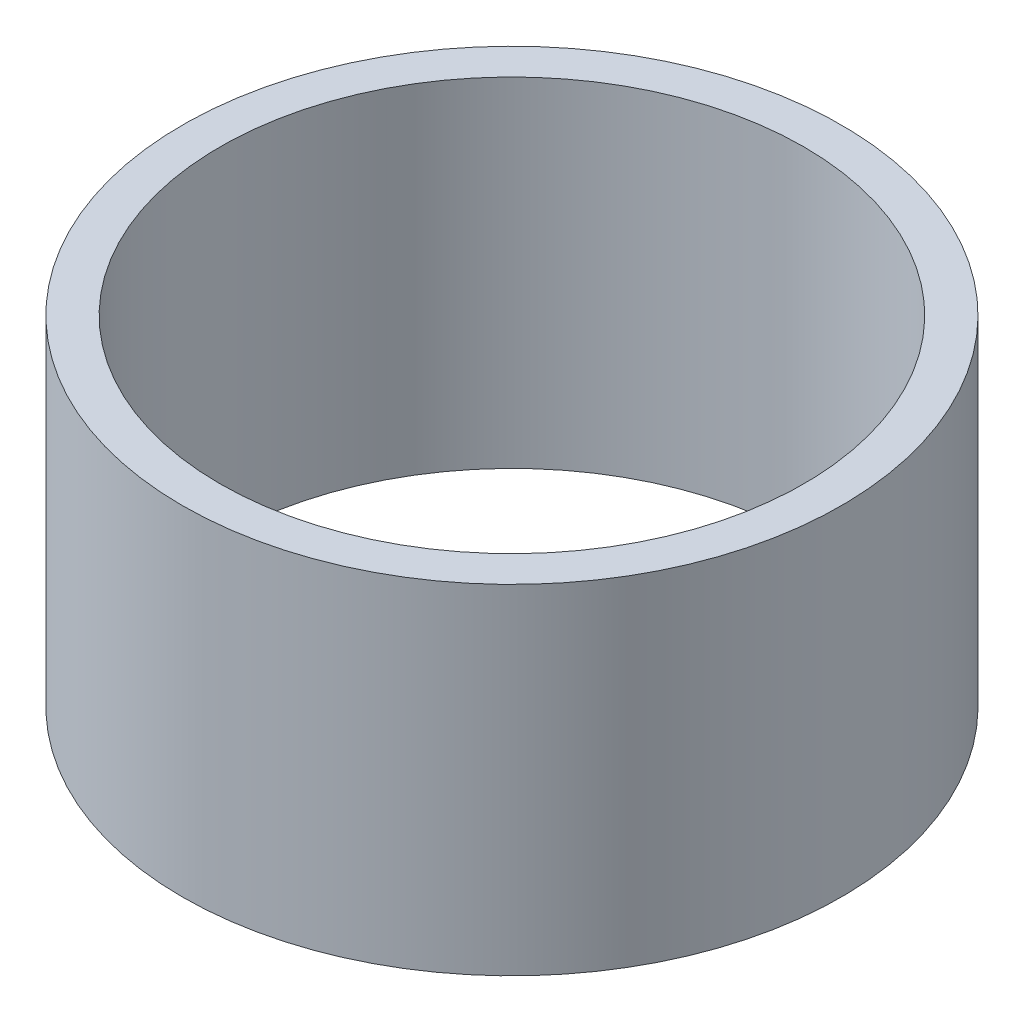
ISO-10303-21;
HEADER;
FILE_DESCRIPTION(('STEP AP214'),'2;1');
FILE_NAME('part.step','',(''),(''),'','','');
FILE_SCHEMA(('AUTOMOTIVE_DESIGN { 1 0 10303 214 1 1 1 1 }'));
ENDSEC;
DATA;
#1=APPLICATION_CONTEXT('core data for automotive mechanical design processes');
#2=APPLICATION_PROTOCOL_DEFINITION('international standard','automotive_design',2000,#1);
#3=PRODUCT_CONTEXT('',#1,'mechanical');
#4=PRODUCT('Part','Part','',(#3));
#5=PRODUCT_RELATED_PRODUCT_CATEGORY('part','',(#4));
#6=PRODUCT_DEFINITION_FORMATION('','',#4);
#7=PRODUCT_DEFINITION_CONTEXT('part definition',#1,'design');
#8=PRODUCT_DEFINITION('design','',#6,#7);
#9=PRODUCT_DEFINITION_SHAPE('','',#8);
#10=(LENGTH_UNIT() NAMED_UNIT(*) SI_UNIT(.MILLI.,.METRE.));
#11=(NAMED_UNIT(*) PLANE_ANGLE_UNIT() SI_UNIT($,.RADIAN.));
#12=(NAMED_UNIT(*) SI_UNIT($,.STERADIAN.) SOLID_ANGLE_UNIT());
#13=UNCERTAINTY_MEASURE_WITH_UNIT(LENGTH_MEASURE(1.E-05),#10,'distance_accuracy_value','');
#14=(GEOMETRIC_REPRESENTATION_CONTEXT(3) GLOBAL_UNCERTAINTY_ASSIGNED_CONTEXT((#13)) GLOBAL_UNIT_ASSIGNED_CONTEXT((#10,
#11,#12)) REPRESENTATION_CONTEXT('',''));
#15=CARTESIAN_POINT('',(0.,0.,0.));
#16=DIRECTION('',(0.,0.,1.));
#17=DIRECTION('',(1.,0.,0.));
#18=AXIS2_PLACEMENT_3D('',#15,#16,#17);
#19=CARTESIAN_POINT('',(0.,18.,0.));
#20=DIRECTION('',(0.,-1.,0.));
#21=DIRECTION('',(0.,0.,-1.));
#22=AXIS2_PLACEMENT_3D('',#19,#20,#21);
#23=CYLINDRICAL_SURFACE('',#22,17.5);
#24=CARTESIAN_POINT('',(0.,18.,0.));
#25=DIRECTION('',(0.,1.,0.));
#26=DIRECTION('',(0.,0.,1.));
#27=AXIS2_PLACEMENT_3D('',#24,#25,#26);
#28=CIRCLE('',#27,17.5);
#29=CARTESIAN_POINT('',(0.,18.,17.5));
#30=VERTEX_POINT('',#29);
#31=EDGE_CURVE('E10',#30,#30,#28,.T.);
#32=ORIENTED_EDGE('',*,*,#31,.F.);
#33=EDGE_LOOP('',(#32));
#34=FACE_BOUND('',#33,.T.);
#35=CARTESIAN_POINT('',(0.,0.,0.));
#36=DIRECTION('',(0.,1.,0.));
#37=DIRECTION('',(0.,0.,1.));
#38=AXIS2_PLACEMENT_3D('',#35,#36,#37);
#39=CIRCLE('',#38,17.5);
#40=CARTESIAN_POINT('',(0.,0.,17.5));
#41=VERTEX_POINT('',#40);
#42=EDGE_CURVE('E42',#41,#41,#39,.T.);
#43=ORIENTED_EDGE('',*,*,#42,.T.);
#44=EDGE_LOOP('',(#43));
#45=FACE_BOUND('',#44,.T.);
#46=ADVANCED_FACE('F39',(#34,#45),#23,.T.);
#47=CARTESIAN_POINT('',(0.,18.,0.));
#48=DIRECTION('',(0.,1.,0.));
#49=DIRECTION('',(0.,0.,1.));
#50=AXIS2_PLACEMENT_3D('',#47,#48,#49);
#51=PLANE('',#50);
#52=CARTESIAN_POINT('',(0.,18.,0.));
#53=DIRECTION('',(0.,1.,0.));
#54=DIRECTION('',(0.,0.,1.));
#55=AXIS2_PLACEMENT_3D('',#52,#53,#54);
#56=CIRCLE('',#55,15.5);
#57=CARTESIAN_POINT('',(0.,18.,15.5));
#58=VERTEX_POINT('',#57);
#59=EDGE_CURVE('E56',#58,#58,#56,.T.);
#60=ORIENTED_EDGE('',*,*,#59,.F.);
#61=EDGE_LOOP('',(#60));
#62=FACE_BOUND('',#61,.T.);
#63=ORIENTED_EDGE('',*,*,#31,.T.);
#64=EDGE_LOOP('',(#63));
#65=FACE_BOUND('',#64,.T.);
#66=ADVANCED_FACE('F63',(#62,#65),#51,.T.);
#67=CARTESIAN_POINT('',(0.,0.,0.));
#68=DIRECTION('',(0.,1.,0.));
#69=DIRECTION('',(0.,0.,1.));
#70=AXIS2_PLACEMENT_3D('',#67,#68,#69);
#71=PLANE('',#70);
#72=CARTESIAN_POINT('',(0.,0.,0.));
#73=DIRECTION('',(0.,1.,0.));
#74=DIRECTION('',(0.,0.,1.));
#75=AXIS2_PLACEMENT_3D('',#72,#73,#74);
#76=CIRCLE('',#75,15.5);
#77=CARTESIAN_POINT('',(0.,0.,15.5));
#78=VERTEX_POINT('',#77);
#79=EDGE_CURVE('E51',#78,#78,#76,.F.);
#80=ORIENTED_EDGE('',*,*,#79,.F.);
#81=EDGE_LOOP('',(#80));
#82=FACE_BOUND('',#81,.T.);
#83=ORIENTED_EDGE('',*,*,#42,.F.);
#84=EDGE_LOOP('',(#83));
#85=FACE_BOUND('',#84,.T.);
#86=ADVANCED_FACE('F65',(#82,#85),#71,.F.);
#87=CARTESIAN_POINT('',(0.,-43.840620433566,0.));
#88=DIRECTION('',(0.,1.,0.));
#89=DIRECTION('',(0.,0.,1.));
#90=AXIS2_PLACEMENT_3D('',#87,#88,#89);
#91=CYLINDRICAL_SURFACE('',#90,15.5);
#92=ORIENTED_EDGE('',*,*,#79,.T.);
#93=EDGE_LOOP('',(#92));
#94=FACE_BOUND('',#93,.T.);
#95=ORIENTED_EDGE('',*,*,#59,.T.);
#96=EDGE_LOOP('',(#95));
#97=FACE_BOUND('',#96,.T.);
#98=ADVANCED_FACE('F61',(#94,#97),#91,.F.);
#99=CLOSED_SHELL('',(#46,#66,#86,#98));
#100=MANIFOLD_SOLID_BREP('B2',#99);
#101=ADVANCED_BREP_SHAPE_REPRESENTATION('',(#18,#100),#14);
#102=SHAPE_DEFINITION_REPRESENTATION(#9,#101);
ENDSEC;
END-ISO-10303-21;
